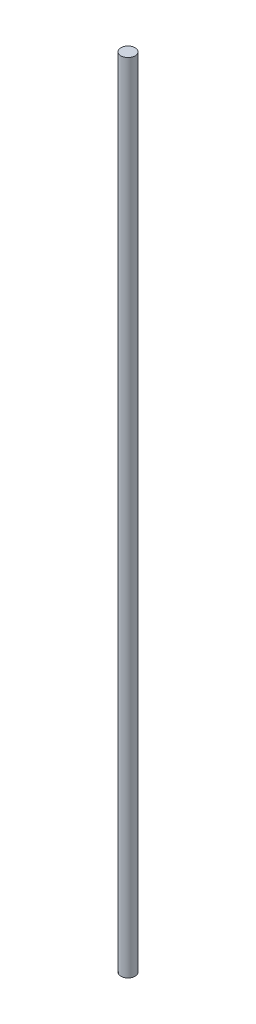
ISO-10303-21;
HEADER;
FILE_DESCRIPTION(('STEP AP214'),'2;1');
FILE_NAME('part.step','',(''),(''),'','','');
FILE_SCHEMA(('AUTOMOTIVE_DESIGN { 1 0 10303 214 1 1 1 1 }'));
ENDSEC;
DATA;
#1=APPLICATION_CONTEXT('core data for automotive mechanical design processes');
#2=APPLICATION_PROTOCOL_DEFINITION('international standard','automotive_design',2000,#1);
#3=PRODUCT_CONTEXT('',#1,'mechanical');
#4=PRODUCT('Part','Part','',(#3));
#5=PRODUCT_RELATED_PRODUCT_CATEGORY('part','',(#4));
#6=PRODUCT_DEFINITION_FORMATION('','',#4);
#7=PRODUCT_DEFINITION_CONTEXT('part definition',#1,'design');
#8=PRODUCT_DEFINITION('design','',#6,#7);
#9=PRODUCT_DEFINITION_SHAPE('','',#8);
#10=(LENGTH_UNIT() NAMED_UNIT(*) SI_UNIT(.MILLI.,.METRE.));
#11=(NAMED_UNIT(*) PLANE_ANGLE_UNIT() SI_UNIT($,.RADIAN.));
#12=(NAMED_UNIT(*) SI_UNIT($,.STERADIAN.) SOLID_ANGLE_UNIT());
#13=UNCERTAINTY_MEASURE_WITH_UNIT(LENGTH_MEASURE(1.E-05),#10,'distance_accuracy_value','');
#14=(GEOMETRIC_REPRESENTATION_CONTEXT(3) GLOBAL_UNCERTAINTY_ASSIGNED_CONTEXT((#13)) GLOBAL_UNIT_ASSIGNED_CONTEXT((#10,
#11,#12)) REPRESENTATION_CONTEXT('',''));
#15=CARTESIAN_POINT('',(0.,0.,0.));
#16=DIRECTION('',(0.,0.,1.));
#17=DIRECTION('',(1.,0.,0.));
#18=AXIS2_PLACEMENT_3D('',#15,#16,#17);
#19=CARTESIAN_POINT('',(0.,225.,0.));
#20=DIRECTION('',(0.,-1.,0.));
#21=DIRECTION('',(0.,0.,-1.));
#22=AXIS2_PLACEMENT_3D('',#19,#20,#21);
#23=PLANE('',#22);
#24=CARTESIAN_POINT('',(0.,225.,0.));
#25=DIRECTION('',(0.,-1.,0.));
#26=DIRECTION('',(0.,0.,-1.));
#27=AXIS2_PLACEMENT_3D('',#24,#25,#26);
#28=CIRCLE('',#27,4.);
#29=CARTESIAN_POINT('',(0.,225.,-4.));
#30=VERTEX_POINT('',#29);
#31=EDGE_CURVE('E11',#30,#30,#28,.T.);
#32=ORIENTED_EDGE('',*,*,#31,.F.);
#33=EDGE_LOOP('',(#32));
#34=FACE_BOUND('',#33,.T.);
#35=ADVANCED_FACE('F16',(#34),#23,.F.);
#36=CARTESIAN_POINT('',(0.,-225.,0.));
#37=DIRECTION('',(0.,-1.,0.));
#38=DIRECTION('',(0.,0.,-1.));
#39=AXIS2_PLACEMENT_3D('',#36,#37,#38);
#40=PLANE('',#39);
#41=CARTESIAN_POINT('',(0.,-225.,0.));
#42=DIRECTION('',(0.,-1.,0.));
#43=DIRECTION('',(0.,0.,-1.));
#44=AXIS2_PLACEMENT_3D('',#41,#42,#43);
#45=CIRCLE('',#44,4.);
#46=CARTESIAN_POINT('',(0.,-225.,-4.));
#47=VERTEX_POINT('',#46);
#48=EDGE_CURVE('E19',#47,#47,#45,.T.);
#49=ORIENTED_EDGE('',*,*,#48,.T.);
#50=EDGE_LOOP('',(#49));
#51=FACE_BOUND('',#50,.T.);
#52=ADVANCED_FACE('F38',(#51),#40,.T.);
#53=CARTESIAN_POINT('',(0.,-225.,0.));
#54=DIRECTION('',(0.,1.,0.));
#55=DIRECTION('',(0.,0.,1.));
#56=AXIS2_PLACEMENT_3D('',#53,#54,#55);
#57=CYLINDRICAL_SURFACE('',#56,4.);
#58=ORIENTED_EDGE('',*,*,#31,.T.);
#59=EDGE_LOOP('',(#58));
#60=FACE_BOUND('',#59,.T.);
#61=ORIENTED_EDGE('',*,*,#48,.F.);
#62=EDGE_LOOP('',(#61));
#63=FACE_BOUND('',#62,.T.);
#64=ADVANCED_FACE('F51',(#60,#63),#57,.T.);
#65=CLOSED_SHELL('',(#35,#52,#64));
#66=MANIFOLD_SOLID_BREP('B1',#65);
#67=ADVANCED_BREP_SHAPE_REPRESENTATION('',(#18,#66),#14);
#68=SHAPE_DEFINITION_REPRESENTATION(#9,#67);
ENDSEC;
END-ISO-10303-21;
